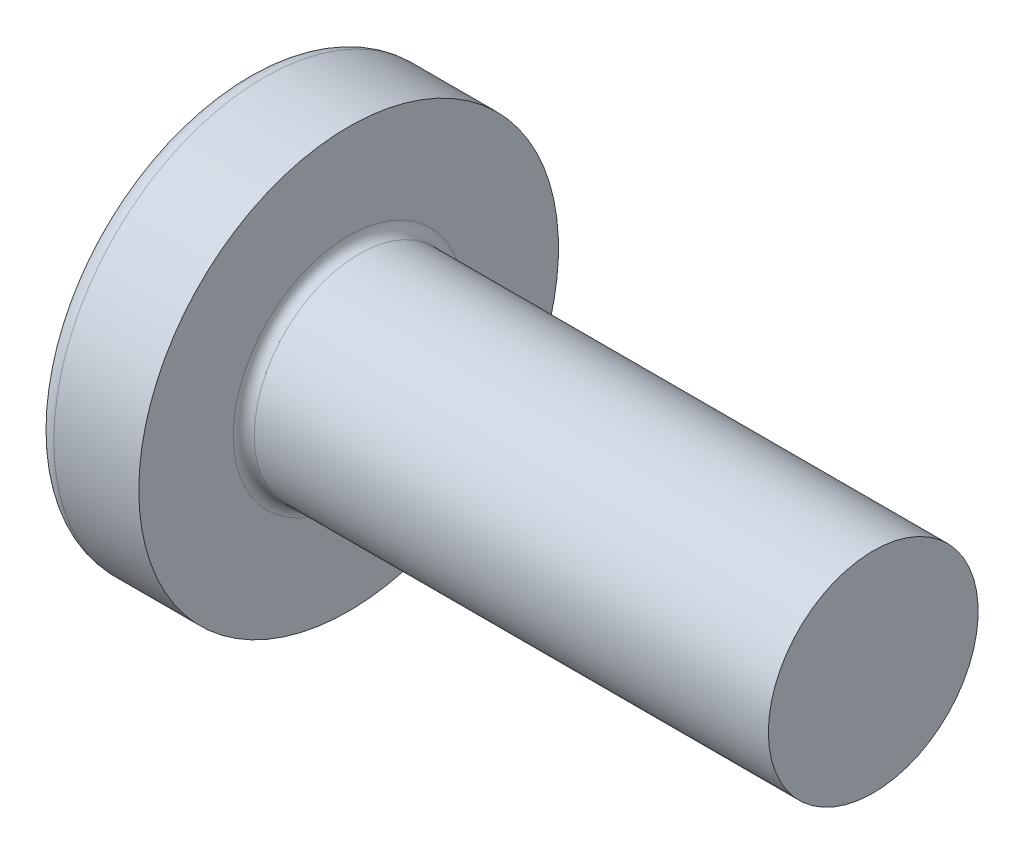
ISO-10303-21;
HEADER;
FILE_DESCRIPTION(('STEP AP214'),'2;1');
FILE_NAME('part.step','',(''),(''),'','','');
FILE_SCHEMA(('AUTOMOTIVE_DESIGN { 1 0 10303 214 1 1 1 1 }'));
ENDSEC;
DATA;
#1=APPLICATION_CONTEXT('core data for automotive mechanical design processes');
#2=APPLICATION_PROTOCOL_DEFINITION('international standard','automotive_design',2000,#1);
#3=PRODUCT_CONTEXT('',#1,'mechanical');
#4=PRODUCT('Part','Part','',(#3));
#5=PRODUCT_RELATED_PRODUCT_CATEGORY('part','',(#4));
#6=PRODUCT_DEFINITION_FORMATION('','',#4);
#7=PRODUCT_DEFINITION_CONTEXT('part definition',#1,'design');
#8=PRODUCT_DEFINITION('design','',#6,#7);
#9=PRODUCT_DEFINITION_SHAPE('','',#8);
#10=(LENGTH_UNIT() NAMED_UNIT(*) SI_UNIT(.MILLI.,.METRE.));
#11=(NAMED_UNIT(*) PLANE_ANGLE_UNIT() SI_UNIT($,.RADIAN.));
#12=(NAMED_UNIT(*) SI_UNIT($,.STERADIAN.) SOLID_ANGLE_UNIT());
#13=UNCERTAINTY_MEASURE_WITH_UNIT(LENGTH_MEASURE(1.E-05),#10,'distance_accuracy_value','');
#14=(GEOMETRIC_REPRESENTATION_CONTEXT(3) GLOBAL_UNCERTAINTY_ASSIGNED_CONTEXT((#13)) GLOBAL_UNIT_ASSIGNED_CONTEXT((#10,
#11,#12)) REPRESENTATION_CONTEXT('',''));
#15=CARTESIAN_POINT('',(0.,0.,0.));
#16=DIRECTION('',(0.,0.,1.));
#17=DIRECTION('',(1.,0.,0.));
#18=AXIS2_PLACEMENT_3D('',#15,#16,#17);
#19=CARTESIAN_POINT('',(3.2,0.,0.));
#20=DIRECTION('',(-1.,0.,0.));
#21=DIRECTION('',(0.,1.,0.));
#22=AXIS2_PLACEMENT_3D('',#19,#20,#21);
#23=SPHERICAL_SURFACE('',#22,3.2);
#24=CARTESIAN_POINT('',(0.646379599446113,0.,0.));
#25=DIRECTION('',(-1.,0.,0.));
#26=DIRECTION('',(0.,0.,1.));
#27=AXIS2_PLACEMENT_3D('',#24,#25,#26);
#28=CIRCLE('',#27,1.92847682119205);
#29=CARTESIAN_POINT('',(0.646379599446113,0.,1.92847682119205));
#30=VERTEX_POINT('',#29);
#31=EDGE_CURVE('E237',#30,#30,#28,.T.);
#32=ORIENTED_EDGE('',*,*,#31,.T.);
#33=EDGE_LOOP('',(#32));
#34=FACE_BOUND('',#33,.T.);
#35=CARTESIAN_POINT('',(0.0321614467928854,0.,0.));
#36=DIRECTION('',(1.,0.,0.));
#37=DIRECTION('',(0.,0.,-1.));
#38=AXIS2_PLACEMENT_3D('',#35,#36,#37);
#39=CIRCLE('',#38,0.452547125518057);
#40=CARTESIAN_POINT('',(0.0321614467928853,-0.239999999999999,-0.38366508938742));
#41=VERTEX_POINT('',#40);
#42=CARTESIAN_POINT('',(0.0321614467928856,-0.383665089387422,-0.24));
#43=VERTEX_POINT('',#42);
#44=EDGE_CURVE('E373',#41,#43,#39,.F.);
#45=ORIENTED_EDGE('',*,*,#44,.F.);
#46=CARTESIAN_POINT('',(3.2,-0.24,0.));
#47=DIRECTION('',(0.,1.,0.));
#48=DIRECTION('',(0.,0.,1.));
#49=AXIS2_PLACEMENT_3D('',#46,#47,#48);
#50=CIRCLE('',#49,3.19098730802866);
#51=CARTESIAN_POINT('',(0.160076673366102,-0.239999999999996,-0.970188728128244));
#52=VERTEX_POINT('',#51);
#53=EDGE_CURVE('E299',#52,#41,#50,.T.);
#54=ORIENTED_EDGE('',*,*,#53,.F.);
#55=CARTESIAN_POINT('',(2.98218780828175,0.,0.436863744320002));
#56=DIRECTION('',(0.446197753347436,0.,-0.894934391398443));
#57=DIRECTION('',(-0.894934391398442,0.,-0.446197753347436));
#58=AXIS2_PLACEMENT_3D('',#55,#56,#57);
#59=CIRCLE('',#58,3.16254769419176);
#60=CARTESIAN_POINT('',(0.160076673366102,0.240000000000003,-0.970188728128242));
#61=VERTEX_POINT('',#60);
#62=EDGE_CURVE('E271',#52,#61,#59,.T.);
#63=ORIENTED_EDGE('',*,*,#62,.T.);
#64=CARTESIAN_POINT('',(3.2,0.24,0.));
#65=DIRECTION('',(0.,-1.,0.));
#66=DIRECTION('',(0.,0.,-1.));
#67=AXIS2_PLACEMENT_3D('',#64,#65,#66);
#68=CIRCLE('',#67,3.19098730802866);
#69=CARTESIAN_POINT('',(0.0321614467928849,0.240000000000001,-0.383665089387418));
#70=VERTEX_POINT('',#69);
#71=EDGE_CURVE('E326',#70,#61,#68,.T.);
#72=ORIENTED_EDGE('',*,*,#71,.F.);
#73=CARTESIAN_POINT('',(0.0321614467928856,0.383665089387422,-0.24));
#74=VERTEX_POINT('',#73);
#75=EDGE_CURVE('E392',#74,#70,#39,.F.);
#76=ORIENTED_EDGE('',*,*,#75,.F.);
#77=CARTESIAN_POINT('',(3.2,0.,-0.24));
#78=DIRECTION('',(0.,0.,1.));
#79=DIRECTION('',(1.,0.,0.));
#80=AXIS2_PLACEMENT_3D('',#77,#78,#79);
#81=CIRCLE('',#80,3.19098730802866);
#82=CARTESIAN_POINT('',(0.160076673366102,0.970188728128244,-0.24));
#83=VERTEX_POINT('',#82);
#84=EDGE_CURVE('E265',#83,#74,#81,.T.);
#85=ORIENTED_EDGE('',*,*,#84,.F.);
#86=CARTESIAN_POINT('',(2.98218780828175,-0.436863744320003,0.));
#87=DIRECTION('',(0.446197753347436,0.894934391398443,0.));
#88=DIRECTION('',(-0.894934391398443,0.446197753347436,0.));
#89=AXIS2_PLACEMENT_3D('',#86,#87,#88);
#90=CIRCLE('',#89,3.16254769419176);
#91=CARTESIAN_POINT('',(0.160076673366102,0.970188728128244,0.24));
#92=VERTEX_POINT('',#91);
#93=EDGE_CURVE('E268',#83,#92,#90,.T.);
#94=ORIENTED_EDGE('',*,*,#93,.T.);
#95=CARTESIAN_POINT('',(3.2,0.,0.24));
#96=DIRECTION('',(0.,0.,-1.));
#97=DIRECTION('',(0.,1.,0.));
#98=AXIS2_PLACEMENT_3D('',#95,#96,#97);
#99=CIRCLE('',#98,3.19098730802866);
#100=CARTESIAN_POINT('',(0.0321614467928852,0.38366508938742,0.24));
#101=VERTEX_POINT('',#100);
#102=EDGE_CURVE('E261',#101,#92,#99,.T.);
#103=ORIENTED_EDGE('',*,*,#102,.F.);
#104=CARTESIAN_POINT('',(0.0321614467928846,0.239999999999999,0.38366508938742));
#105=VERTEX_POINT('',#104);
#106=EDGE_CURVE('E391',#105,#101,#39,.F.);
#107=ORIENTED_EDGE('',*,*,#106,.F.);
#108=CARTESIAN_POINT('',(0.160076673366102,0.239999999999997,0.970188728128244));
#109=VERTEX_POINT('',#108);
#110=EDGE_CURVE('E281',#109,#105,#68,.T.);
#111=ORIENTED_EDGE('',*,*,#110,.F.);
#112=CARTESIAN_POINT('',(2.98218780828175,0.,-0.436863744320003));
#113=DIRECTION('',(0.446197753347436,0.,0.894934391398443));
#114=DIRECTION('',(0.894934391398443,0.,-0.446197753347436));
#115=AXIS2_PLACEMENT_3D('',#112,#113,#114);
#116=CIRCLE('',#115,3.16254769419176);
#117=CARTESIAN_POINT('',(0.160076673366102,-0.240000000000003,0.970188728128243));
#118=VERTEX_POINT('',#117);
#119=EDGE_CURVE('E48',#109,#118,#116,.T.);
#120=ORIENTED_EDGE('',*,*,#119,.T.);
#121=CARTESIAN_POINT('',(0.032161446792885,-0.240000000000001,0.383665089387418));
#122=VERTEX_POINT('',#121);
#123=EDGE_CURVE('E278',#122,#118,#50,.T.);
#124=ORIENTED_EDGE('',*,*,#123,.F.);
#125=CARTESIAN_POINT('',(0.0321614467928852,-0.38366508938742,0.24));
#126=VERTEX_POINT('',#125);
#127=EDGE_CURVE('E427',#126,#122,#39,.F.);
#128=ORIENTED_EDGE('',*,*,#127,.F.);
#129=CARTESIAN_POINT('',(0.160076673366102,-0.970188728128243,0.24));
#130=VERTEX_POINT('',#129);
#131=EDGE_CURVE('E262',#130,#126,#99,.T.);
#132=ORIENTED_EDGE('',*,*,#131,.F.);
#133=CARTESIAN_POINT('',(2.98218780828175,0.436863744320002,0.));
#134=DIRECTION('',(0.446197753347436,-0.894934391398443,0.));
#135=DIRECTION('',(0.894934391398442,0.446197753347436,0.));
#136=AXIS2_PLACEMENT_3D('',#133,#134,#135);
#137=CIRCLE('',#136,3.16254769419176);
#138=CARTESIAN_POINT('',(0.160076673366102,-0.970188728128243,-0.24));
#139=VERTEX_POINT('',#138);
#140=EDGE_CURVE('E258',#130,#139,#137,.T.);
#141=ORIENTED_EDGE('',*,*,#140,.T.);
#142=EDGE_CURVE('E63',#43,#139,#81,.T.);
#143=ORIENTED_EDGE('',*,*,#142,.F.);
#144=EDGE_LOOP('',(#45,#54,#63,#72,#76,#85,#94,#103,#107,#111,#120,#124,#128,#132,#141,#143));
#145=FACE_BOUND('',#144,.T.);
#146=ADVANCED_FACE('F35',(#34,#145),#23,.T.);
#147=CARTESIAN_POINT('',(1.42,0.342014234961647,-0.24));
#148=DIRECTION('',(0.,0.,1.));
#149=DIRECTION('',(1.,0.,0.));
#150=AXIS2_PLACEMENT_3D('',#147,#148,#149);
#151=PLANE('',#150);
#152=ORIENTED_EDGE('',*,*,#84,.T.);
#153=CARTESIAN_POINT('',(-0.626811087646334,0.437068483432734,-0.24));
#154=CARTESIAN_POINT('',(-0.489788496188269,0.426133650699674,-0.24));
#155=CARTESIAN_POINT('',(-0.352772750896661,0.415111501640762,-0.24));
#156=CARTESIAN_POINT('',(-0.0787578829644788,0.392826208775377,-0.24));
#157=CARTESIAN_POINT('',(0.0582412392502152,0.381563059737591,-0.24));
#158=CARTESIAN_POINT('',(0.332213907654152,0.358729879929546,-0.24));
#159=CARTESIAN_POINT('',(0.469187453856034,0.347159849311358,-0.24));
#160=CARTESIAN_POINT('',(0.743097225439296,0.323608060039765,-0.24));
#161=CARTESIAN_POINT('',(0.880033451350376,0.311626307573655,-0.24));
#162=CARTESIAN_POINT('',(1.12503843743479,0.289667437089413,-0.24));
#163=CARTESIAN_POINT('',(1.23311691792,0.279799173776849,-0.24));
#164=CARTESIAN_POINT('',(1.4492267018282,0.259570129968442,-0.24));
#165=CARTESIAN_POINT('',(1.55725800577256,0.249209355061897,-0.24));
#166=CARTESIAN_POINT('',(1.77325939831777,0.227783788850472,-0.24));
#167=CARTESIAN_POINT('',(1.88122948205844,0.216718947894399,-0.24));
#168=CARTESIAN_POINT('',(2.04309848476113,0.199296215271932,-0.24));
#169=CARTESIAN_POINT('',(2.09704158415864,0.193350927204474,-0.24));
#170=CARTESIAN_POINT('',(2.20488609252136,0.181086542764125,-0.24));
#171=CARTESIAN_POINT('',(2.25878750075649,0.174767439988846,-0.24));
#172=CARTESIAN_POINT('',(2.31266102213859,0.168212174791089,-0.24));
#173=B_SPLINE_CURVE_WITH_KNOTS('',3,(#153,#154,#155,#156,#157,#158,#159,#160,#161,#162,#163,
#164,#165,#166,#167,#168,#169,#170,#171,#172),.UNSPECIFIED.,.F.,.F.,(4,2,2,2,2,2,2,2,2,4),(0.,
0.412374804430943,0.824758569256476,1.23714212973639,1.64951949568622,1.97510284899868,
2.30068250829037,2.62628515317116,2.78909323564388,2.95190410736571),.UNSPECIFIED.);
#174=CARTESIAN_POINT('',(1.42,0.262259890185289,-0.240000000000001));
#175=VERTEX_POINT('',#174);
#176=EDGE_CURVE('E413',#74,#175,#173,.T.);
#177=ORIENTED_EDGE('',*,*,#176,.T.);
#178=DIRECTION('',(0.,1.,0.));
#179=VECTOR('',#178,1.);
#180=CARTESIAN_POINT('',(1.42,-0.342014234961647,-0.24));
#181=LINE('',#180,#179);
#182=CARTESIAN_POINT('',(1.42,0.342014234961647,-0.24));
#183=VERTEX_POINT('',#182);
#184=EDGE_CURVE('E355',#175,#183,#181,.T.);
#185=ORIENTED_EDGE('',*,*,#184,.T.);
#186=DIRECTION('',(0.894934391398442,-0.446197753347436,0.));
#187=VECTOR('',#186,1.);
#188=CARTESIAN_POINT('',(0.,1.05,-0.24));
#189=LINE('',#188,#187);
#190=EDGE_CURVE('E238',#83,#183,#189,.T.);
#191=ORIENTED_EDGE('',*,*,#190,.F.);
#192=EDGE_LOOP('',(#152,#177,#185,#191));
#193=FACE_BOUND('',#192,.T.);
#194=ADVANCED_FACE('F193',(#193),#151,.T.);
#195=CARTESIAN_POINT('',(1.42,-0.342014234961647,-0.24));
#196=VERTEX_POINT('',#195);
#197=CARTESIAN_POINT('',(1.42,-0.262259890185289,-0.240000000000001));
#198=VERTEX_POINT('',#197);
#199=EDGE_CURVE('E246',#196,#198,#181,.T.);
#200=ORIENTED_EDGE('',*,*,#199,.T.);
#201=CARTESIAN_POINT('',(-0.626811087646335,-0.437068483432734,-0.24));
#202=CARTESIAN_POINT('',(-0.489788496188269,-0.426133650699674,-0.24));
#203=CARTESIAN_POINT('',(-0.352772750896661,-0.415111501640762,-0.24));
#204=CARTESIAN_POINT('',(-0.078757882964479,-0.392826208775377,-0.24));
#205=CARTESIAN_POINT('',(0.058241239250215,-0.381563059737591,-0.24));
#206=CARTESIAN_POINT('',(0.332213907654151,-0.358729879929546,-0.24));
#207=CARTESIAN_POINT('',(0.469187453856033,-0.347159849311358,-0.24));
#208=CARTESIAN_POINT('',(0.743097225439296,-0.323608060039765,-0.24));
#209=CARTESIAN_POINT('',(0.880033451350376,-0.311626307573655,-0.24));
#210=CARTESIAN_POINT('',(1.12503843743479,-0.289667437089413,-0.24));
#211=CARTESIAN_POINT('',(1.23311691791999,-0.279799173776849,-0.24));
#212=CARTESIAN_POINT('',(1.4492267018282,-0.259570129968442,-0.24));
#213=CARTESIAN_POINT('',(1.55725800577256,-0.249209355061897,-0.24));
#214=CARTESIAN_POINT('',(1.77325939831777,-0.227783788850472,-0.24));
#215=CARTESIAN_POINT('',(1.88122948205844,-0.216718947894399,-0.24));
#216=CARTESIAN_POINT('',(2.04309848476113,-0.199296215271932,-0.24));
#217=CARTESIAN_POINT('',(2.09704158415864,-0.193350927204474,-0.24));
#218=CARTESIAN_POINT('',(2.20488609252136,-0.181086542764125,-0.24));
#219=CARTESIAN_POINT('',(2.25878750075649,-0.174767439988846,-0.24));
#220=CARTESIAN_POINT('',(2.31266102213859,-0.168212174791089,-0.24));
#221=B_SPLINE_CURVE_WITH_KNOTS('',3,(#201,#202,#203,#204,#205,#206,#207,#208,#209,#210,#211,
#212,#213,#214,#215,#216,#217,#218,#219,#220),.UNSPECIFIED.,.F.,.F.,(4,2,2,2,2,2,2,2,2,4),(0.,
0.412374804430943,0.824758569256476,1.23714212973639,1.64951949568622,1.97510284899868,
2.30068250829037,2.62628515317116,2.78909323564388,2.95190410736571),.UNSPECIFIED.);
#222=EDGE_CURVE('E390',#198,#43,#221,.F.);
#223=ORIENTED_EDGE('',*,*,#222,.T.);
#224=ORIENTED_EDGE('',*,*,#142,.T.);
#225=DIRECTION('',(0.894934391398442,0.446197753347436,0.));
#226=VECTOR('',#225,1.);
#227=CARTESIAN_POINT('',(0.,-1.05,-0.24));
#228=LINE('',#227,#226);
#229=EDGE_CURVE('E329',#139,#196,#228,.T.);
#230=ORIENTED_EDGE('',*,*,#229,.T.);
#231=EDGE_LOOP('',(#200,#223,#224,#230));
#232=FACE_BOUND('',#231,.T.);
#233=ADVANCED_FACE('F199',(#232),#151,.T.);
#234=CARTESIAN_POINT('',(1.42,-0.342014234961647,0.24));
#235=DIRECTION('',(0.,0.,-1.));
#236=DIRECTION('',(0.,1.,0.));
#237=AXIS2_PLACEMENT_3D('',#234,#235,#236);
#238=PLANE('',#237);
#239=DIRECTION('',(0.,-1.,0.));
#240=VECTOR('',#239,1.);
#241=CARTESIAN_POINT('',(1.42,0.342014234961647,0.24));
#242=LINE('',#241,#240);
#243=CARTESIAN_POINT('',(1.42,0.342014234961647,0.24));
#244=VERTEX_POINT('',#243);
#245=CARTESIAN_POINT('',(1.42,0.262259890185289,0.240000000000001));
#246=VERTEX_POINT('',#245);
#247=EDGE_CURVE('E338',#244,#246,#242,.T.);
#248=ORIENTED_EDGE('',*,*,#247,.T.);
#249=CARTESIAN_POINT('',(-0.626811087646335,0.437068483432734,0.24));
#250=CARTESIAN_POINT('',(-0.489788496188269,0.426133650699674,0.24));
#251=CARTESIAN_POINT('',(-0.352772750896661,0.415111501640762,0.24));
#252=CARTESIAN_POINT('',(-0.078757882964479,0.392826208775377,0.24));
#253=CARTESIAN_POINT('',(0.058241239250215,0.381563059737591,0.24));
#254=CARTESIAN_POINT('',(0.332213907654151,0.358729879929546,0.24));
#255=CARTESIAN_POINT('',(0.469187453856033,0.347159849311357,0.24));
#256=CARTESIAN_POINT('',(0.743097225439296,0.323608060039765,0.24));
#257=CARTESIAN_POINT('',(0.880033451350376,0.311626307573655,0.24));
#258=CARTESIAN_POINT('',(1.12503843743479,0.289667437089413,0.24));
#259=CARTESIAN_POINT('',(1.23311691791999,0.279799173776849,0.24));
#260=CARTESIAN_POINT('',(1.4492267018282,0.259570129968442,0.24));
#261=CARTESIAN_POINT('',(1.55725800577256,0.249209355061897,0.24));
#262=CARTESIAN_POINT('',(1.77325939831777,0.227783788850472,0.24));
#263=CARTESIAN_POINT('',(1.88122948205844,0.216718947894399,0.24));
#264=CARTESIAN_POINT('',(2.04309848476113,0.199296215271932,0.24));
#265=CARTESIAN_POINT('',(2.09704158415864,0.193350927204474,0.24));
#266=CARTESIAN_POINT('',(2.20488609252136,0.181086542764125,0.24));
#267=CARTESIAN_POINT('',(2.25878750075649,0.174767439988846,0.24));
#268=CARTESIAN_POINT('',(2.31266102213859,0.168212174791089,0.24));
#269=B_SPLINE_CURVE_WITH_KNOTS('',3,(#249,#250,#251,#252,#253,#254,#255,#256,#257,#258,#259,
#260,#261,#262,#263,#264,#265,#266,#267,#268),.UNSPECIFIED.,.F.,.F.,(4,2,2,2,2,2,2,2,2,4),(0.,
0.412374804430943,0.824758569256476,1.23714212973639,1.64951949568622,1.97510284899869,
2.30068250829037,2.62628515317116,2.78909323564388,2.95190410736571),.UNSPECIFIED.);
#270=EDGE_CURVE('E665',#246,#101,#269,.F.);
#271=ORIENTED_EDGE('',*,*,#270,.T.);
#272=ORIENTED_EDGE('',*,*,#102,.T.);
#273=DIRECTION('',(0.894934391398442,-0.446197753347436,0.));
#274=VECTOR('',#273,1.);
#275=CARTESIAN_POINT('',(0.,1.05,0.24));
#276=LINE('',#275,#274);
#277=EDGE_CURVE('E243',#92,#244,#276,.T.);
#278=ORIENTED_EDGE('',*,*,#277,.T.);
#279=EDGE_LOOP('',(#248,#271,#272,#278));
#280=FACE_BOUND('',#279,.T.);
#281=ADVANCED_FACE('F409',(#280),#238,.T.);
#282=ORIENTED_EDGE('',*,*,#131,.T.);
#283=CARTESIAN_POINT('',(-0.626811087693631,-0.437068483436507,0.24));
#284=CARTESIAN_POINT('',(-0.489788496230298,-0.426133650703048,0.24));
#285=CARTESIAN_POINT('',(-0.352772750933423,-0.415111501643733,0.24));
#286=CARTESIAN_POINT('',(-0.0787578829907066,-0.392826208777529,0.24));
#287=CARTESIAN_POINT('',(0.0582412392292542,-0.381563059739326,0.24));
#288=CARTESIAN_POINT('',(0.332213907649303,-0.358729879929962,0.24));
#289=CARTESIAN_POINT('',(0.46918745386203,-0.347159849310859,0.24));
#290=CARTESIAN_POINT('',(0.743097225466974,-0.323608060037368,0.24));
#291=CARTESIAN_POINT('',(0.880033451388892,-0.311626307570274,0.24));
#292=CARTESIAN_POINT('',(1.12503843748414,-0.289667437084935,0.24));
#293=CARTESIAN_POINT('',(1.23311691796933,-0.279799173772307,0.24));
#294=CARTESIAN_POINT('',(1.44922670187753,-0.259570129963748,0.24));
#295=CARTESIAN_POINT('',(1.55725800582188,-0.249209355057115,0.24));
#296=CARTESIAN_POINT('',(1.77325939836707,-0.227783788845471,0.24));
#297=CARTESIAN_POINT('',(1.88122948210773,-0.216718947889267,0.24));
#298=CARTESIAN_POINT('',(2.0430984848104,-0.199296215266543,0.24));
#299=CARTESIAN_POINT('',(2.0970415842079,-0.193350927198989,0.24));
#300=CARTESIAN_POINT('',(2.20488609257059,-0.181086542758414,0.24));
#301=CARTESIAN_POINT('',(2.25878750080571,-0.174767439983005,0.24));
#302=CARTESIAN_POINT('',(2.31266102218779,-0.168212174785095,0.24));
#303=B_SPLINE_CURVE_WITH_KNOTS('',3,(#283,#284,#285,#286,#287,#288,#289,#290,#291,#292,#293,
#294,#295,#296,#297,#298,#299,#300,#301,#302),.UNSPECIFIED.,.F.,.F.,(4,2,2,2,2,2,2,2,2,4),(0.,
0.412374804446791,0.824758569288174,1.23714212980074,1.64951949578321,1.97510284909568,
2.30068250838737,2.62628515326816,2.78909323574089,2.95190410746272),.UNSPECIFIED.);
#304=CARTESIAN_POINT('',(1.42,-0.262259890185289,0.240000000000001));
#305=VERTEX_POINT('',#304);
#306=EDGE_CURVE('E428',#126,#305,#303,.T.);
#307=ORIENTED_EDGE('',*,*,#306,.T.);
#308=CARTESIAN_POINT('',(1.42,-0.342014234961648,0.24));
#309=VERTEX_POINT('',#308);
#310=EDGE_CURVE('E340',#305,#309,#242,.T.);
#311=ORIENTED_EDGE('',*,*,#310,.T.);
#312=DIRECTION('',(0.894934391398442,0.446197753347436,0.));
#313=VECTOR('',#312,1.);
#314=CARTESIAN_POINT('',(0.,-1.05,0.24));
#315=LINE('',#314,#313);
#316=EDGE_CURVE('E331',#130,#309,#315,.T.);
#317=ORIENTED_EDGE('',*,*,#316,.F.);
#318=EDGE_LOOP('',(#282,#307,#311,#317));
#319=FACE_BOUND('',#318,.T.);
#320=ADVANCED_FACE('F513',(#319),#238,.T.);
#321=CARTESIAN_POINT('',(1.42,0.342014234961647,0.24));
#322=DIRECTION('',(0.446197753347436,0.894934391398443,0.));
#323=DIRECTION('',(-0.894934391398443,0.446197753347436,0.));
#324=AXIS2_PLACEMENT_3D('',#321,#322,#323);
#325=PLANE('',#324);
#326=CARTESIAN_POINT('',(2.01772965253961,0.0439972734550526,0.));
#327=DIRECTION('',(0.446197753347436,0.894934391398443,0.));
#328=DIRECTION('',(-0.894934391398443,0.446197753347436,0.));
#329=AXIS2_PLACEMENT_3D('',#326,#327,#328);
#330=ELLIPSE('',#329,0.703057486597294,0.310602005333466);
#331=CARTESIAN_POINT('',(1.42,0.342014234961648,0.096987179996113));
#332=VERTEX_POINT('',#331);
#333=CARTESIAN_POINT('',(1.42,0.342014234961648,-0.096987179996113));
#334=VERTEX_POINT('',#333);
#335=EDGE_CURVE('E304',#332,#334,#330,.F.);
#336=ORIENTED_EDGE('',*,*,#335,.F.);
#337=DIRECTION('',(0.,0.,-1.));
#338=VECTOR('',#337,1.);
#339=CARTESIAN_POINT('',(1.42,0.342014234961647,0.24));
#340=LINE('',#339,#338);
#341=EDGE_CURVE('E341',#244,#332,#340,.T.);
#342=ORIENTED_EDGE('',*,*,#341,.F.);
#343=ORIENTED_EDGE('',*,*,#277,.F.);
#344=ORIENTED_EDGE('',*,*,#93,.F.);
#345=ORIENTED_EDGE('',*,*,#190,.T.);
#346=EDGE_CURVE('E343',#334,#183,#340,.T.);
#347=ORIENTED_EDGE('',*,*,#346,.F.);
#348=EDGE_LOOP('',(#336,#342,#343,#344,#345,#347));
#349=FACE_BOUND('',#348,.T.);
#350=ADVANCED_FACE('F407',(#349),#325,.F.);
#351=CARTESIAN_POINT('',(0.,-1.05,-0.24));
#352=DIRECTION('',(0.446197753347436,-0.894934391398443,0.));
#353=DIRECTION('',(0.894934391398442,0.446197753347436,0.));
#354=AXIS2_PLACEMENT_3D('',#351,#352,#353);
#355=PLANE('',#354);
#356=CARTESIAN_POINT('',(2.01772965253961,-0.0439972734550525,0.));
#357=DIRECTION('',(0.446197753347436,-0.894934391398443,0.));
#358=DIRECTION('',(-0.894934391398443,-0.446197753347436,0.));
#359=AXIS2_PLACEMENT_3D('',#356,#357,#358);
#360=ELLIPSE('',#359,0.703057486597294,0.310602005333466);
#361=CARTESIAN_POINT('',(1.42,-0.342014234961649,-0.0969871799961112));
#362=VERTEX_POINT('',#361);
#363=CARTESIAN_POINT('',(1.42,-0.342014234961649,0.0969871799961112));
#364=VERTEX_POINT('',#363);
#365=EDGE_CURVE('E667',#362,#364,#360,.F.);
#366=ORIENTED_EDGE('',*,*,#365,.F.);
#367=DIRECTION('',(0.,0.,1.));
#368=VECTOR('',#367,1.);
#369=CARTESIAN_POINT('',(1.42,-0.342014234961647,-0.24));
#370=LINE('',#369,#368);
#371=EDGE_CURVE('E334',#196,#362,#370,.T.);
#372=ORIENTED_EDGE('',*,*,#371,.F.);
#373=ORIENTED_EDGE('',*,*,#229,.F.);
#374=ORIENTED_EDGE('',*,*,#140,.F.);
#375=ORIENTED_EDGE('',*,*,#316,.T.);
#376=EDGE_CURVE('E337',#364,#309,#370,.T.);
#377=ORIENTED_EDGE('',*,*,#376,.F.);
#378=EDGE_LOOP('',(#366,#372,#373,#374,#375,#377));
#379=FACE_BOUND('',#378,.T.);
#380=ADVANCED_FACE('F500',(#379),#355,.F.);
#381=CARTESIAN_POINT('',(1.42,0.342014234961647,-0.24));
#382=DIRECTION('',(-1.,0.,0.));
#383=DIRECTION('',(0.,0.,1.));
#384=AXIS2_PLACEMENT_3D('',#381,#382,#383);
#385=PLANE('',#384);
#386=DIRECTION('',(0.,1.,0.));
#387=VECTOR('',#386,1.);
#388=CARTESIAN_POINT('',(1.42,-0.240000000000001,0.342014234961646));
#389=LINE('',#388,#387);
#390=CARTESIAN_POINT('',(1.42,-0.240000000000001,0.342014234961646));
#391=VERTEX_POINT('',#390);
#392=CARTESIAN_POINT('',(1.42,-0.0969871799961179,0.342014234961647));
#393=VERTEX_POINT('',#392);
#394=EDGE_CURVE('E319',#391,#393,#389,.T.);
#395=ORIENTED_EDGE('',*,*,#394,.T.);
#396=CARTESIAN_POINT('',(1.42,0.,0.));
#397=DIRECTION('',(-1.,0.,0.));
#398=DIRECTION('',(0.,0.,1.));
#399=AXIS2_PLACEMENT_3D('',#396,#397,#398);
#400=CIRCLE('',#399,0.3555);
#401=CARTESIAN_POINT('',(1.42,-0.240000000000001,0.262259890185289));
#402=VERTEX_POINT('',#401);
#403=EDGE_CURVE('E693',#402,#393,#400,.T.);
#404=ORIENTED_EDGE('',*,*,#403,.F.);
#405=DIRECTION('',(0.,0.,-1.));
#406=VECTOR('',#405,1.);
#407=CARTESIAN_POINT('',(1.42,-0.240000000000001,0.342014234961646));
#408=LINE('',#407,#406);
#409=EDGE_CURVE('E315',#391,#402,#408,.T.);
#410=ORIENTED_EDGE('',*,*,#409,.F.);
#411=EDGE_LOOP('',(#395,#404,#410));
#412=FACE_BOUND('',#411,.T.);
#413=ADVANCED_FACE('F493',(#412),#385,.T.);
#414=ORIENTED_EDGE('',*,*,#310,.F.);
#415=EDGE_CURVE('E698',#364,#305,#400,.T.);
#416=ORIENTED_EDGE('',*,*,#415,.F.);
#417=ORIENTED_EDGE('',*,*,#376,.T.);
#418=EDGE_LOOP('',(#414,#416,#417));
#419=FACE_BOUND('',#418,.T.);
#420=ADVANCED_FACE('F486',(#419),#385,.T.);
#421=ORIENTED_EDGE('',*,*,#371,.T.);
#422=EDGE_CURVE('E384',#198,#362,#400,.T.);
#423=ORIENTED_EDGE('',*,*,#422,.F.);
#424=ORIENTED_EDGE('',*,*,#199,.F.);
#425=EDGE_LOOP('',(#421,#423,#424));
#426=FACE_BOUND('',#425,.T.);
#427=ADVANCED_FACE('F480',(#426),#385,.T.);
#428=CARTESIAN_POINT('',(1.42,-0.239999999999999,-0.262259890185288));
#429=VERTEX_POINT('',#428);
#430=CARTESIAN_POINT('',(1.42,-0.239999999999999,-0.342014234961648));
#431=VERTEX_POINT('',#430);
#432=EDGE_CURVE('E318',#429,#431,#408,.T.);
#433=ORIENTED_EDGE('',*,*,#432,.F.);
#434=CARTESIAN_POINT('',(1.42,-0.0969871799961142,-0.342014234961648));
#435=VERTEX_POINT('',#434);
#436=EDGE_CURVE('E55',#435,#429,#400,.T.);
#437=ORIENTED_EDGE('',*,*,#436,.F.);
#438=DIRECTION('',(0.,-1.,0.));
#439=VECTOR('',#438,1.);
#440=CARTESIAN_POINT('',(1.42,0.240000000000001,-0.342014234961647));
#441=LINE('',#440,#439);
#442=EDGE_CURVE('E314',#435,#431,#441,.T.);
#443=ORIENTED_EDGE('',*,*,#442,.T.);
#444=EDGE_LOOP('',(#433,#437,#443));
#445=FACE_BOUND('',#444,.T.);
#446=ADVANCED_FACE('F379',(#445),#385,.T.);
#447=CARTESIAN_POINT('',(1.42,0.240000000000001,-0.342014234961647));
#448=VERTEX_POINT('',#447);
#449=CARTESIAN_POINT('',(1.42,0.0969871799961166,-0.342014234961647));
#450=VERTEX_POINT('',#449);
#451=EDGE_CURVE('E311',#448,#450,#441,.T.);
#452=ORIENTED_EDGE('',*,*,#451,.T.);
#453=CARTESIAN_POINT('',(1.42,0.240000000000001,-0.262259890185289));
#454=VERTEX_POINT('',#453);
#455=EDGE_CURVE('E383',#454,#450,#400,.T.);
#456=ORIENTED_EDGE('',*,*,#455,.F.);
#457=DIRECTION('',(0.,0.,1.));
#458=VECTOR('',#457,1.);
#459=CARTESIAN_POINT('',(1.42,0.240000000000001,-0.342014234961647));
#460=LINE('',#459,#458);
#461=EDGE_CURVE('E323',#448,#454,#460,.T.);
#462=ORIENTED_EDGE('',*,*,#461,.F.);
#463=EDGE_LOOP('',(#452,#456,#462));
#464=FACE_BOUND('',#463,.T.);
#465=ADVANCED_FACE('F468',(#464),#385,.T.);
#466=ORIENTED_EDGE('',*,*,#184,.F.);
#467=EDGE_CURVE('E682',#334,#175,#400,.T.);
#468=ORIENTED_EDGE('',*,*,#467,.F.);
#469=ORIENTED_EDGE('',*,*,#346,.T.);
#470=EDGE_LOOP('',(#466,#468,#469));
#471=FACE_BOUND('',#470,.T.);
#472=ADVANCED_FACE('F461',(#471),#385,.T.);
#473=ORIENTED_EDGE('',*,*,#341,.T.);
#474=EDGE_CURVE('E684',#246,#332,#400,.T.);
#475=ORIENTED_EDGE('',*,*,#474,.F.);
#476=ORIENTED_EDGE('',*,*,#247,.F.);
#477=EDGE_LOOP('',(#473,#475,#476));
#478=FACE_BOUND('',#477,.T.);
#479=ADVANCED_FACE('F455',(#478),#385,.T.);
#480=CARTESIAN_POINT('',(1.42,0.239999999999999,0.342014234961648));
#481=DIRECTION('',(0.,-1.,0.));
#482=DIRECTION('',(1.,0.,0.));
#483=AXIS2_PLACEMENT_3D('',#480,#481,#482);
#484=PLANE('',#483);
#485=ORIENTED_EDGE('',*,*,#110,.T.);
#486=CARTESIAN_POINT('',(-0.626811087646335,0.239999999999998,0.437068483432735));
#487=CARTESIAN_POINT('',(-0.489788496188269,0.239999999999999,0.426133650699675));
#488=CARTESIAN_POINT('',(-0.352772750896661,0.239999999999999,0.415111501640762));
#489=CARTESIAN_POINT('',(-0.078757882964479,0.239999999999999,0.392826208775378));
#490=CARTESIAN_POINT('',(0.058241239250215,0.239999999999999,0.381563059737592));
#491=CARTESIAN_POINT('',(0.332213907654151,0.239999999999999,0.358729879929547));
#492=CARTESIAN_POINT('',(0.469187453856033,0.239999999999999,0.347159849311358));
#493=CARTESIAN_POINT('',(0.743097225439296,0.239999999999999,0.323608060039766));
#494=CARTESIAN_POINT('',(0.880033451350376,0.239999999999999,0.311626307573656));
#495=CARTESIAN_POINT('',(1.12503843743479,0.239999999999999,0.289667437089414));
#496=CARTESIAN_POINT('',(1.23311691791999,0.239999999999999,0.27979917377685));
#497=CARTESIAN_POINT('',(1.4492267018282,0.239999999999999,0.259570129968443));
#498=CARTESIAN_POINT('',(1.55725800577256,0.239999999999999,0.249209355061898));
#499=CARTESIAN_POINT('',(1.77325939831777,0.239999999999999,0.227783788850473));
#500=CARTESIAN_POINT('',(1.88122948205844,0.239999999999999,0.216718947894399));
#501=CARTESIAN_POINT('',(2.04309848476113,0.239999999999999,0.199296215271933));
#502=CARTESIAN_POINT('',(2.09704158415864,0.239999999999999,0.193350927204475));
#503=CARTESIAN_POINT('',(2.20488609252136,0.239999999999999,0.181086542764126));
#504=CARTESIAN_POINT('',(2.25878750075649,0.239999999999999,0.174767439988847));
#505=CARTESIAN_POINT('',(2.31266102213859,0.239999999999999,0.16821217479109));
#506=B_SPLINE_CURVE_WITH_KNOTS('',3,(#486,#487,#488,#489,#490,#491,#492,#493,#494,#495,#496,
#497,#498,#499,#500,#501,#502,#503,#504,#505),.UNSPECIFIED.,.F.,.F.,(4,2,2,2,2,2,2,2,2,4),(0.,
0.412374804430943,0.824758569256476,1.23714212973639,1.64951949568622,1.97510284899868,
2.30068250829037,2.62628515317116,2.78909323564388,2.95190410736571),.UNSPECIFIED.);
#507=CARTESIAN_POINT('',(1.42,0.239999999999999,0.26225989018529));
#508=VERTEX_POINT('',#507);
#509=EDGE_CURVE('E664',#105,#508,#506,.T.);
#510=ORIENTED_EDGE('',*,*,#509,.T.);
#511=CARTESIAN_POINT('',(1.42,0.239999999999999,0.342014234961648));
#512=VERTEX_POINT('',#511);
#513=EDGE_CURVE('E296',#508,#512,#460,.T.);
#514=ORIENTED_EDGE('',*,*,#513,.T.);
#515=DIRECTION('',(0.894934391398442,0.,-0.446197753347436));
#516=VECTOR('',#515,1.);
#517=CARTESIAN_POINT('',(0.,0.239999999999996,1.05));
#518=LINE('',#517,#516);
#519=EDGE_CURVE('E289',#109,#512,#518,.T.);
#520=ORIENTED_EDGE('',*,*,#519,.F.);
#521=EDGE_LOOP('',(#485,#510,#514,#520));
#522=FACE_BOUND('',#521,.T.);
#523=ADVANCED_FACE('F293',(#522),#484,.T.);
#524=CARTESIAN_POINT('',(1.42,-0.239999999999999,-0.342014234961648));
#525=DIRECTION('',(0.,1.,0.));
#526=DIRECTION('',(0.,0.,1.));
#527=AXIS2_PLACEMENT_3D('',#524,#525,#526);
#528=PLANE('',#527);
#529=ORIENTED_EDGE('',*,*,#409,.T.);
#530=CARTESIAN_POINT('',(-0.626811087646334,-0.240000000000002,0.437068483432733));
#531=CARTESIAN_POINT('',(-0.489788496188269,-0.240000000000001,0.426133650699673));
#532=CARTESIAN_POINT('',(-0.352772750896661,-0.240000000000001,0.415111501640761));
#533=CARTESIAN_POINT('',(-0.0787578829644788,-0.240000000000001,0.392826208775376));
#534=CARTESIAN_POINT('',(0.0582412392502152,-0.240000000000001,0.38156305973759));
#535=CARTESIAN_POINT('',(0.332213907654152,-0.240000000000001,0.358729879929545));
#536=CARTESIAN_POINT('',(0.469187453856034,-0.240000000000001,0.347159849311357));
#537=CARTESIAN_POINT('',(0.743097225439296,-0.240000000000001,0.323608060039764));
#538=CARTESIAN_POINT('',(0.880033451350376,-0.240000000000001,0.311626307573654));
#539=CARTESIAN_POINT('',(1.12503843743479,-0.240000000000001,0.289667437089413));
#540=CARTESIAN_POINT('',(1.23311691791999,-0.240000000000001,0.279799173776848));
#541=CARTESIAN_POINT('',(1.4492267018282,-0.240000000000001,0.259570129968441));
#542=CARTESIAN_POINT('',(1.55725800577256,-0.240000000000001,0.249209355061896));
#543=CARTESIAN_POINT('',(1.77325939831777,-0.240000000000001,0.227783788850472));
#544=CARTESIAN_POINT('',(1.88122948205844,-0.240000000000001,0.216718947894398));
#545=CARTESIAN_POINT('',(2.04309848476113,-0.240000000000001,0.199296215271931));
#546=CARTESIAN_POINT('',(2.09704158415864,-0.240000000000001,0.193350927204474));
#547=CARTESIAN_POINT('',(2.20488609252136,-0.240000000000001,0.181086542764124));
#548=CARTESIAN_POINT('',(2.25878750075649,-0.240000000000001,0.174767439988845));
#549=CARTESIAN_POINT('',(2.31266102213859,-0.240000000000001,0.168212174791088));
#550=B_SPLINE_CURVE_WITH_KNOTS('',3,(#530,#531,#532,#533,#534,#535,#536,#537,#538,#539,#540,
#541,#542,#543,#544,#545,#546,#547,#548,#549),.UNSPECIFIED.,.F.,.F.,(4,2,2,2,2,2,2,2,2,4),(0.,
0.412374804430943,0.824758569256476,1.23714212973639,1.64951949568622,1.97510284899868,
2.30068250829037,2.62628515317116,2.78909323564388,2.95190410736571),.UNSPECIFIED.);
#551=EDGE_CURVE('E421',#402,#122,#550,.F.);
#552=ORIENTED_EDGE('',*,*,#551,.T.);
#553=ORIENTED_EDGE('',*,*,#123,.T.);
#554=DIRECTION('',(0.894934391398442,0.,-0.446197753347436));
#555=VECTOR('',#554,1.);
#556=CARTESIAN_POINT('',(0.,-0.240000000000004,1.05));
#557=LINE('',#556,#555);
#558=EDGE_CURVE('E291',#118,#391,#557,.T.);
#559=ORIENTED_EDGE('',*,*,#558,.T.);
#560=EDGE_LOOP('',(#529,#552,#553,#559));
#561=FACE_BOUND('',#560,.T.);
#562=ADVANCED_FACE('F228',(#561),#528,.T.);
#563=CARTESIAN_POINT('',(1.42,-0.240000000000001,0.342014234961646));
#564=DIRECTION('',(0.446197753347436,0.,0.894934391398443));
#565=DIRECTION('',(-0.894934391398443,0.,0.446197753347436));
#566=AXIS2_PLACEMENT_3D('',#563,#564,#565);
#567=PLANE('',#566);
#568=CARTESIAN_POINT('',(2.01772965253961,0.,0.0439972734550526));
#569=DIRECTION('',(0.446197753347436,0.,0.894934391398443));
#570=DIRECTION('',(-0.894934391398443,0.,0.446197753347436));
#571=AXIS2_PLACEMENT_3D('',#568,#569,#570);
#572=ELLIPSE('',#571,0.703057486597294,0.310602005333466);
#573=CARTESIAN_POINT('',(1.42,0.0969871799961155,0.342014234961648));
#574=VERTEX_POINT('',#573);
#575=EDGE_CURVE('E419',#393,#574,#572,.F.);
#576=ORIENTED_EDGE('',*,*,#575,.F.);
#577=ORIENTED_EDGE('',*,*,#394,.F.);
#578=ORIENTED_EDGE('',*,*,#558,.F.);
#579=ORIENTED_EDGE('',*,*,#119,.F.);
#580=ORIENTED_EDGE('',*,*,#519,.T.);
#581=EDGE_CURVE('E322',#574,#512,#389,.T.);
#582=ORIENTED_EDGE('',*,*,#581,.F.);
#583=EDGE_LOOP('',(#576,#577,#578,#579,#580,#582));
#584=FACE_BOUND('',#583,.T.);
#585=ADVANCED_FACE('F287',(#584),#567,.F.);
#586=CARTESIAN_POINT('',(0.,0.240000000000004,-1.05));
#587=DIRECTION('',(0.446197753347436,0.,-0.894934391398443));
#588=DIRECTION('',(0.894934391398442,0.,0.446197753347436));
#589=AXIS2_PLACEMENT_3D('',#586,#587,#588);
#590=PLANE('',#589);
#591=CARTESIAN_POINT('',(2.01772965253961,0.,-0.0439972734550525));
#592=DIRECTION('',(0.446197753347436,0.,-0.894934391398443));
#593=DIRECTION('',(-0.894934391398443,0.,-0.446197753347436));
#594=AXIS2_PLACEMENT_3D('',#591,#592,#593);
#595=ELLIPSE('',#594,0.703057486597294,0.310602005333466);
#596=EDGE_CURVE('E377',#450,#435,#595,.F.);
#597=ORIENTED_EDGE('',*,*,#596,.F.);
#598=ORIENTED_EDGE('',*,*,#451,.F.);
#599=DIRECTION('',(0.894934391398442,0.,0.446197753347436));
#600=VECTOR('',#599,1.);
#601=CARTESIAN_POINT('',(0.,0.240000000000004,-1.05));
#602=LINE('',#601,#600);
#603=EDGE_CURVE('E301',#61,#448,#602,.T.);
#604=ORIENTED_EDGE('',*,*,#603,.F.);
#605=ORIENTED_EDGE('',*,*,#62,.F.);
#606=DIRECTION('',(0.894934391398442,0.,0.446197753347436));
#607=VECTOR('',#606,1.);
#608=CARTESIAN_POINT('',(0.,-0.239999999999996,-1.05));
#609=LINE('',#608,#607);
#610=EDGE_CURVE('E308',#52,#431,#609,.T.);
#611=ORIENTED_EDGE('',*,*,#610,.T.);
#612=ORIENTED_EDGE('',*,*,#442,.F.);
#613=EDGE_LOOP('',(#597,#598,#604,#605,#611,#612));
#614=FACE_BOUND('',#613,.T.);
#615=ADVANCED_FACE('F368',(#614),#590,.F.);
#616=ORIENTED_EDGE('',*,*,#461,.T.);
#617=CARTESIAN_POINT('',(-0.626811087693631,0.240000000000001,-0.437068483436506));
#618=CARTESIAN_POINT('',(-0.489788496230298,0.240000000000001,-0.426133650703047));
#619=CARTESIAN_POINT('',(-0.352772750933423,0.240000000000001,-0.415111501643732));
#620=CARTESIAN_POINT('',(-0.078757882990707,0.240000000000001,-0.392826208777528));
#621=CARTESIAN_POINT('',(0.0582412392292539,0.240000000000001,-0.381563059739325));
#622=CARTESIAN_POINT('',(0.332213907649303,0.240000000000001,-0.358729879929961));
#623=CARTESIAN_POINT('',(0.469187453862029,0.240000000000001,-0.347159849310858));
#624=CARTESIAN_POINT('',(0.743097225466974,0.240000000000001,-0.323608060037367));
#625=CARTESIAN_POINT('',(0.880033451388892,0.240000000000001,-0.311626307570273));
#626=CARTESIAN_POINT('',(1.12503843748414,0.240000000000001,-0.289667437084934));
#627=CARTESIAN_POINT('',(1.23311691796933,0.240000000000001,-0.279799173772306));
#628=CARTESIAN_POINT('',(1.44922670187753,0.240000000000001,-0.259570129963747));
#629=CARTESIAN_POINT('',(1.55725800582188,0.240000000000001,-0.249209355057114));
#630=CARTESIAN_POINT('',(1.77325939836707,0.240000000000001,-0.22778378884547));
#631=CARTESIAN_POINT('',(1.88122948210773,0.240000000000001,-0.216718947889266));
#632=CARTESIAN_POINT('',(2.0430984848104,0.240000000000001,-0.199296215266542));
#633=CARTESIAN_POINT('',(2.0970415842079,0.240000000000001,-0.193350927198988));
#634=CARTESIAN_POINT('',(2.20488609257059,0.240000000000001,-0.181086542758413));
#635=CARTESIAN_POINT('',(2.25878750080571,0.240000000000001,-0.174767439983004));
#636=CARTESIAN_POINT('',(2.31266102218779,0.240000000000001,-0.168212174785094));
#637=B_SPLINE_CURVE_WITH_KNOTS('',3,(#617,#618,#619,#620,#621,#622,#623,#624,#625,#626,#627,
#628,#629,#630,#631,#632,#633,#634,#635,#636),.UNSPECIFIED.,.F.,.F.,(4,2,2,2,2,2,2,2,2,4),(0.,
0.41237480444679,0.824758569288173,1.23714212980074,1.64951949578321,1.97510284909568,
2.30068250838736,2.62628515326816,2.78909323574089,2.95190410746272),.UNSPECIFIED.);
#638=EDGE_CURVE('E364',#454,#70,#637,.F.);
#639=ORIENTED_EDGE('',*,*,#638,.T.);
#640=ORIENTED_EDGE('',*,*,#71,.T.);
#641=ORIENTED_EDGE('',*,*,#603,.T.);
#642=EDGE_LOOP('',(#616,#639,#640,#641));
#643=FACE_BOUND('',#642,.T.);
#644=ADVANCED_FACE('F226',(#643),#484,.T.);
#645=ORIENTED_EDGE('',*,*,#53,.T.);
#646=CARTESIAN_POINT('',(-0.626811087646335,-0.239999999999998,-0.437068483432735));
#647=CARTESIAN_POINT('',(-0.489788496188269,-0.239999999999998,-0.426133650699675));
#648=CARTESIAN_POINT('',(-0.352772750896661,-0.239999999999998,-0.415111501640763));
#649=CARTESIAN_POINT('',(-0.078757882964479,-0.239999999999998,-0.392826208775378));
#650=CARTESIAN_POINT('',(0.058241239250215,-0.239999999999999,-0.381563059737592));
#651=CARTESIAN_POINT('',(0.332213907654151,-0.239999999999999,-0.358729879929547));
#652=CARTESIAN_POINT('',(0.469187453856033,-0.239999999999999,-0.347159849311358));
#653=CARTESIAN_POINT('',(0.743097225439296,-0.239999999999999,-0.323608060039766));
#654=CARTESIAN_POINT('',(0.880033451350376,-0.239999999999999,-0.311626307573656));
#655=CARTESIAN_POINT('',(1.12503843743479,-0.239999999999999,-0.289667437089414));
#656=CARTESIAN_POINT('',(1.23311691791999,-0.239999999999999,-0.27979917377685));
#657=CARTESIAN_POINT('',(1.4492267018282,-0.239999999999999,-0.259570129968443));
#658=CARTESIAN_POINT('',(1.55725800577256,-0.239999999999999,-0.249209355061898));
#659=CARTESIAN_POINT('',(1.77325939831777,-0.239999999999999,-0.227783788850473));
#660=CARTESIAN_POINT('',(1.88122948205844,-0.239999999999999,-0.2167189478944));
#661=CARTESIAN_POINT('',(2.04309848476113,-0.239999999999999,-0.199296215271933));
#662=CARTESIAN_POINT('',(2.09704158415864,-0.239999999999999,-0.193350927204475));
#663=CARTESIAN_POINT('',(2.20488609252136,-0.239999999999999,-0.181086542764126));
#664=CARTESIAN_POINT('',(2.25878750075649,-0.239999999999999,-0.174767439988847));
#665=CARTESIAN_POINT('',(2.31266102213859,-0.239999999999999,-0.16821217479109));
#666=B_SPLINE_CURVE_WITH_KNOTS('',3,(#646,#647,#648,#649,#650,#651,#652,#653,#654,#655,#656,
#657,#658,#659,#660,#661,#662,#663,#664,#665),.UNSPECIFIED.,.F.,.F.,(4,2,2,2,2,2,2,2,2,4),(0.,
0.412374804430943,0.824758569256476,1.23714212973639,1.64951949568622,1.97510284899868,
2.30068250829037,2.62628515317116,2.78909323564388,2.95190410736571),.UNSPECIFIED.);
#667=EDGE_CURVE('E11',#41,#429,#666,.T.);
#668=ORIENTED_EDGE('',*,*,#667,.T.);
#669=ORIENTED_EDGE('',*,*,#432,.T.);
#670=ORIENTED_EDGE('',*,*,#610,.F.);
#671=EDGE_LOOP('',(#645,#668,#669,#670));
#672=FACE_BOUND('',#671,.T.);
#673=ADVANCED_FACE('F221',(#672),#528,.T.);
#674=CARTESIAN_POINT('',(-25.4,0.,0.));
#675=DIRECTION('',(-1.,0.,0.));
#676=DIRECTION('',(0.,0.,1.));
#677=AXIS2_PLACEMENT_3D('',#674,#675,#676);
#678=CYLINDRICAL_SURFACE('',#677,1.);
#679=CARTESIAN_POINT('',(1.7,0.,0.));
#680=DIRECTION('',(-1.,0.,0.));
#681=DIRECTION('',(0.,0.,1.));
#682=AXIS2_PLACEMENT_3D('',#679,#680,#681);
#683=CIRCLE('',#682,1.);
#684=CARTESIAN_POINT('',(1.7,0.,1.));
#685=VERTEX_POINT('',#684);
#686=EDGE_CURVE('E232',#685,#685,#683,.F.);
#687=ORIENTED_EDGE('',*,*,#686,.T.);
#688=EDGE_LOOP('',(#687));
#689=FACE_BOUND('',#688,.T.);
#690=CARTESIAN_POINT('',(6.6,0.,0.));
#691=DIRECTION('',(-1.,0.,0.));
#692=DIRECTION('',(0.,0.,1.));
#693=AXIS2_PLACEMENT_3D('',#690,#691,#692);
#694=CIRCLE('',#693,1.);
#695=CARTESIAN_POINT('',(6.6,0.,1.));
#696=VERTEX_POINT('',#695);
#697=EDGE_CURVE('E235',#696,#696,#694,.T.);
#698=ORIENTED_EDGE('',*,*,#697,.T.);
#699=EDGE_LOOP('',(#698));
#700=FACE_BOUND('',#699,.T.);
#701=ADVANCED_FACE('F218',(#689,#700),#678,.T.);
#702=CARTESIAN_POINT('',(1.6,1.,0.));
#703=DIRECTION('',(-1.,0.,0.));
#704=DIRECTION('',(0.,0.,1.));
#705=AXIS2_PLACEMENT_3D('',#702,#703,#704);
#706=PLANE('',#705);
#707=CARTESIAN_POINT('',(1.6,0.,0.));
#708=DIRECTION('',(-1.,0.,0.));
#709=DIRECTION('',(0.,0.,1.));
#710=AXIS2_PLACEMENT_3D('',#707,#708,#709);
#711=CIRCLE('',#710,1.1);
#712=CARTESIAN_POINT('',(1.6,0.,1.1));
#713=VERTEX_POINT('',#712);
#714=EDGE_CURVE('E254',#713,#713,#711,.T.);
#715=ORIENTED_EDGE('',*,*,#714,.T.);
#716=EDGE_LOOP('',(#715));
#717=FACE_BOUND('',#716,.T.);
#718=CARTESIAN_POINT('',(1.6,0.,0.));
#719=DIRECTION('',(-1.,0.,0.));
#720=DIRECTION('',(0.,0.,1.));
#721=AXIS2_PLACEMENT_3D('',#718,#719,#720);
#722=CIRCLE('',#721,2.);
#723=CARTESIAN_POINT('',(1.6,0.,2.));
#724=VERTEX_POINT('',#723);
#725=EDGE_CURVE('E251',#724,#724,#722,.T.);
#726=ORIENTED_EDGE('',*,*,#725,.F.);
#727=EDGE_LOOP('',(#726));
#728=FACE_BOUND('',#727,.T.);
#729=ADVANCED_FACE('F215',(#717,#728),#706,.F.);
#730=CARTESIAN_POINT('',(-25.4,0.,0.));
#731=DIRECTION('',(-1.,0.,0.));
#732=DIRECTION('',(0.,0.,1.));
#733=AXIS2_PLACEMENT_3D('',#730,#731,#732);
#734=CYLINDRICAL_SURFACE('',#733,2.);
#735=ORIENTED_EDGE('',*,*,#725,.T.);
#736=EDGE_LOOP('',(#735));
#737=FACE_BOUND('',#736,.T.);
#738=CARTESIAN_POINT('',(0.790020746977267,0.,0.));
#739=DIRECTION('',(-1.,0.,0.));
#740=DIRECTION('',(0.,0.,1.));
#741=AXIS2_PLACEMENT_3D('',#738,#739,#740);
#742=CIRCLE('',#741,2.);
#743=CARTESIAN_POINT('',(0.790020746977267,0.,2.));
#744=VERTEX_POINT('',#743);
#745=EDGE_CURVE('E240',#744,#744,#742,.T.);
#746=ORIENTED_EDGE('',*,*,#745,.F.);
#747=EDGE_LOOP('',(#746));
#748=FACE_BOUND('',#747,.T.);
#749=ADVANCED_FACE('F211',(#737,#748),#734,.T.);
#750=CARTESIAN_POINT('',(0.790020746977269,0.,0.));
#751=DIRECTION('',(-1.,0.,0.));
#752=DIRECTION('',(0.,0.,1.));
#753=AXIS2_PLACEMENT_3D('',#750,#751,#752);
#754=TOROIDAL_SURFACE('',#753,1.82,0.18);
#755=ORIENTED_EDGE('',*,*,#745,.T.);
#756=EDGE_LOOP('',(#755));
#757=FACE_BOUND('',#756,.T.);
#758=ORIENTED_EDGE('',*,*,#31,.F.);
#759=EDGE_LOOP('',(#758));
#760=FACE_BOUND('',#759,.T.);
#761=ADVANCED_FACE('F208',(#757,#760),#754,.T.);
#762=CARTESIAN_POINT('',(6.6,1.,0.));
#763=DIRECTION('',(1.,0.,0.));
#764=DIRECTION('',(0.,0.,-1.));
#765=AXIS2_PLACEMENT_3D('',#762,#763,#764);
#766=PLANE('',#765);
#767=ORIENTED_EDGE('',*,*,#697,.F.);
#768=EDGE_LOOP('',(#767));
#769=FACE_BOUND('',#768,.T.);
#770=ADVANCED_FACE('F206',(#769),#766,.T.);
#771=CARTESIAN_POINT('',(1.7,0.,0.));
#772=DIRECTION('',(-1.,0.,0.));
#773=DIRECTION('',(0.,0.,1.));
#774=AXIS2_PLACEMENT_3D('',#771,#772,#773);
#775=TOROIDAL_SURFACE('',#774,1.1,0.1);
#776=ORIENTED_EDGE('',*,*,#686,.F.);
#777=EDGE_LOOP('',(#776));
#778=FACE_BOUND('',#777,.T.);
#779=ORIENTED_EDGE('',*,*,#714,.F.);
#780=EDGE_LOOP('',(#779));
#781=FACE_BOUND('',#780,.T.);
#782=ADVANCED_FACE('F37',(#778,#781),#775,.F.);
#783=ORIENTED_EDGE('',*,*,#513,.F.);
#784=EDGE_CURVE('E385',#574,#508,#400,.T.);
#785=ORIENTED_EDGE('',*,*,#784,.F.);
#786=ORIENTED_EDGE('',*,*,#581,.T.);
#787=EDGE_LOOP('',(#783,#785,#786));
#788=FACE_BOUND('',#787,.T.);
#789=ADVANCED_FACE('F462',(#788),#385,.T.);
#790=CARTESIAN_POINT('',(1.42,0.,0.));
#791=DIRECTION('',(-1.,0.,0.));
#792=DIRECTION('',(0.,0.,1.));
#793=AXIS2_PLACEMENT_3D('',#790,#791,#792);
#794=CONICAL_SURFACE('',#793,0.3555,0.069813170079766);
#795=ORIENTED_EDGE('',*,*,#335,.T.);
#796=EDGE_CURVE('E679',#332,#334,#400,.T.);
#797=ORIENTED_EDGE('',*,*,#796,.F.);
#798=EDGE_LOOP('',(#795,#797));
#799=FACE_BOUND('',#798,.T.);
#800=ADVANCED_FACE('F190',(#799),#794,.F.);
#801=ORIENTED_EDGE('',*,*,#365,.T.);
#802=EDGE_CURVE('E699',#362,#364,#400,.T.);
#803=ORIENTED_EDGE('',*,*,#802,.F.);
#804=EDGE_LOOP('',(#801,#803));
#805=FACE_BOUND('',#804,.T.);
#806=ADVANCED_FACE('F595',(#805),#794,.F.);
#807=EDGE_CURVE('E387',#508,#246,#400,.T.);
#808=ORIENTED_EDGE('',*,*,#807,.F.);
#809=ORIENTED_EDGE('',*,*,#509,.F.);
#810=ORIENTED_EDGE('',*,*,#106,.T.);
#811=ORIENTED_EDGE('',*,*,#270,.F.);
#812=EDGE_LOOP('',(#808,#809,#810,#811));
#813=FACE_BOUND('',#812,.T.);
#814=ADVANCED_FACE('F601',(#813),#794,.F.);
#815=ORIENTED_EDGE('',*,*,#575,.T.);
#816=EDGE_CURVE('E388',#393,#574,#400,.T.);
#817=ORIENTED_EDGE('',*,*,#816,.F.);
#818=EDGE_LOOP('',(#815,#817));
#819=FACE_BOUND('',#818,.T.);
#820=ADVANCED_FACE('F608',(#819),#794,.F.);
#821=ORIENTED_EDGE('',*,*,#596,.T.);
#822=EDGE_CURVE('E380',#450,#435,#400,.T.);
#823=ORIENTED_EDGE('',*,*,#822,.F.);
#824=EDGE_LOOP('',(#821,#823));
#825=FACE_BOUND('',#824,.T.);
#826=ADVANCED_FACE('F615',(#825),#794,.F.);
#827=ORIENTED_EDGE('',*,*,#127,.T.);
#828=ORIENTED_EDGE('',*,*,#551,.F.);
#829=EDGE_CURVE('E695',#305,#402,#400,.T.);
#830=ORIENTED_EDGE('',*,*,#829,.F.);
#831=ORIENTED_EDGE('',*,*,#306,.F.);
#832=EDGE_LOOP('',(#827,#828,#830,#831));
#833=FACE_BOUND('',#832,.T.);
#834=ADVANCED_FACE('F622',(#833),#794,.F.);
#835=ORIENTED_EDGE('',*,*,#75,.T.);
#836=ORIENTED_EDGE('',*,*,#638,.F.);
#837=EDGE_CURVE('E685',#175,#454,#400,.T.);
#838=ORIENTED_EDGE('',*,*,#837,.F.);
#839=ORIENTED_EDGE('',*,*,#176,.F.);
#840=EDGE_LOOP('',(#835,#836,#838,#839));
#841=FACE_BOUND('',#840,.T.);
#842=ADVANCED_FACE('F188',(#841),#794,.F.);
#843=EDGE_CURVE('E381',#429,#198,#400,.T.);
#844=ORIENTED_EDGE('',*,*,#843,.F.);
#845=ORIENTED_EDGE('',*,*,#667,.F.);
#846=ORIENTED_EDGE('',*,*,#44,.T.);
#847=ORIENTED_EDGE('',*,*,#222,.F.);
#848=EDGE_LOOP('',(#844,#845,#846,#847));
#849=FACE_BOUND('',#848,.T.);
#850=ADVANCED_FACE('F183',(#849),#794,.F.);
#851=CARTESIAN_POINT('',(1.5355089520108,0.,0.));
#852=DIRECTION('',(-1.,0.,0.));
#853=DIRECTION('',(0.,0.,1.));
#854=AXIS2_PLACEMENT_3D('',#851,#852,#853);
#855=CONICAL_SURFACE('',#854,0.,1.25663706143592);
#856=ORIENTED_EDGE('',*,*,#784,.T.);
#857=ORIENTED_EDGE('',*,*,#807,.T.);
#858=ORIENTED_EDGE('',*,*,#474,.T.);
#859=ORIENTED_EDGE('',*,*,#796,.T.);
#860=ORIENTED_EDGE('',*,*,#467,.T.);
#861=ORIENTED_EDGE('',*,*,#837,.T.);
#862=ORIENTED_EDGE('',*,*,#455,.T.);
#863=ORIENTED_EDGE('',*,*,#822,.T.);
#864=ORIENTED_EDGE('',*,*,#436,.T.);
#865=ORIENTED_EDGE('',*,*,#843,.T.);
#866=ORIENTED_EDGE('',*,*,#422,.T.);
#867=ORIENTED_EDGE('',*,*,#802,.T.);
#868=ORIENTED_EDGE('',*,*,#415,.T.);
#869=ORIENTED_EDGE('',*,*,#829,.T.);
#870=ORIENTED_EDGE('',*,*,#403,.T.);
#871=ORIENTED_EDGE('',*,*,#816,.T.);
#872=EDGE_LOOP('',(#856,#857,#858,#859,#860,#861,#862,#863,#864,#865,#866,#867,#868,#869,#870,#871));
#873=FACE_BOUND('',#872,.T.);
#874=CARTESIAN_POINT('',(1.5355089520108,0.,0.));
#875=VERTEX_POINT('',#874);
#876=VERTEX_LOOP('',#875);
#877=FACE_BOUND('',#876,.T.);
#878=ADVANCED_FACE('F181',(#873,#877),#855,.F.);
#879=CLOSED_SHELL('',(#146,#194,#233,#281,#320,#350,#380,#413,#420,#427,#446,#465,#472,#479,
#523,#562,#585,#615,#644,#673,#701,#729,#749,#761,#770,#782,#789,#800,#806,#814,#820,#826,#834,
#842,#850,#878));
#880=MANIFOLD_SOLID_BREP('B2',#879);
#881=ADVANCED_BREP_SHAPE_REPRESENTATION('',(#18,#880),#14);
#882=SHAPE_DEFINITION_REPRESENTATION(#9,#881);
ENDSEC;
END-ISO-10303-21;
